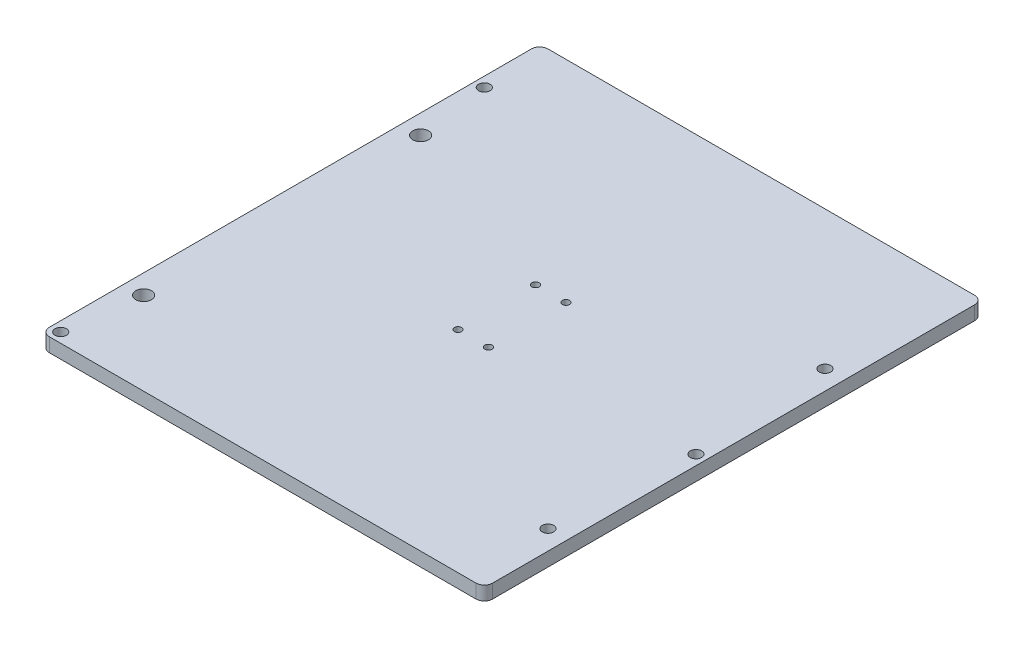
ISO-10303-21;
HEADER;
FILE_DESCRIPTION(('STEP AP214'),'2;1');
FILE_NAME('part.step','',(''),(''),'','','');
FILE_SCHEMA(('AUTOMOTIVE_DESIGN { 1 0 10303 214 1 1 1 1 }'));
ENDSEC;
DATA;
#1=APPLICATION_CONTEXT('core data for automotive mechanical design processes');
#2=APPLICATION_PROTOCOL_DEFINITION('international standard','automotive_design',2000,#1);
#3=PRODUCT_CONTEXT('',#1,'mechanical');
#4=PRODUCT('Part','Part','',(#3));
#5=PRODUCT_RELATED_PRODUCT_CATEGORY('part','',(#4));
#6=PRODUCT_DEFINITION_FORMATION('','',#4);
#7=PRODUCT_DEFINITION_CONTEXT('part definition',#1,'design');
#8=PRODUCT_DEFINITION('design','',#6,#7);
#9=PRODUCT_DEFINITION_SHAPE('','',#8);
#10=(LENGTH_UNIT() NAMED_UNIT(*) SI_UNIT(.MILLI.,.METRE.));
#11=(NAMED_UNIT(*) PLANE_ANGLE_UNIT() SI_UNIT($,.RADIAN.));
#12=(NAMED_UNIT(*) SI_UNIT($,.STERADIAN.) SOLID_ANGLE_UNIT());
#13=UNCERTAINTY_MEASURE_WITH_UNIT(LENGTH_MEASURE(1.E-05),#10,'distance_accuracy_value','');
#14=(GEOMETRIC_REPRESENTATION_CONTEXT(3) GLOBAL_UNCERTAINTY_ASSIGNED_CONTEXT((#13)) GLOBAL_UNIT_ASSIGNED_CONTEXT((#10,
#11,#12)) REPRESENTATION_CONTEXT('',''));
#15=CARTESIAN_POINT('',(0.,0.,0.));
#16=DIRECTION('',(0.,0.,1.));
#17=DIRECTION('',(1.,0.,0.));
#18=AXIS2_PLACEMENT_3D('',#15,#16,#17);
#19=CARTESIAN_POINT('',(0.,6.35,25.4));
#20=DIRECTION('',(0.,0.,-1.));
#21=DIRECTION('',(-1.,0.,0.));
#22=AXIS2_PLACEMENT_3D('',#19,#20,#21);
#23=PLANE('',#22);
#24=DIRECTION('',(1.,0.,0.));
#25=VECTOR('',#24,1.);
#26=CARTESIAN_POINT('',(0.,0.,25.4));
#27=LINE('',#26,#25);
#28=CARTESIAN_POINT('',(3.81,0.,25.4));
#29=VERTEX_POINT('',#28);
#30=CARTESIAN_POINT('',(199.39,0.,25.4));
#31=VERTEX_POINT('',#30);
#32=EDGE_CURVE('E130',#29,#31,#27,.T.);
#33=ORIENTED_EDGE('',*,*,#32,.T.);
#34=DIRECTION('',(0.,-1.,0.));
#35=VECTOR('',#34,1.);
#36=CARTESIAN_POINT('',(199.39,6.35,25.4));
#37=LINE('',#36,#35);
#38=CARTESIAN_POINT('',(199.39,6.35,25.4));
#39=VERTEX_POINT('',#38);
#40=EDGE_CURVE('E11',#31,#39,#37,.F.);
#41=ORIENTED_EDGE('',*,*,#40,.T.);
#42=DIRECTION('',(1.,0.,0.));
#43=VECTOR('',#42,1.);
#44=CARTESIAN_POINT('',(0.,6.35,25.4));
#45=LINE('',#44,#43);
#46=CARTESIAN_POINT('',(3.81,6.35,25.4));
#47=VERTEX_POINT('',#46);
#48=EDGE_CURVE('E156',#47,#39,#45,.T.);
#49=ORIENTED_EDGE('',*,*,#48,.F.);
#50=DIRECTION('',(0.,-1.,0.));
#51=VECTOR('',#50,1.);
#52=CARTESIAN_POINT('',(3.81,6.35,25.4));
#53=LINE('',#52,#51);
#54=EDGE_CURVE('E41',#47,#29,#53,.T.);
#55=ORIENTED_EDGE('',*,*,#54,.T.);
#56=EDGE_LOOP('',(#33,#41,#49,#55));
#57=FACE_BOUND('',#56,.T.);
#58=ADVANCED_FACE('F33',(#57),#23,.F.);
#59=CARTESIAN_POINT('',(203.2,6.35,0.));
#60=DIRECTION('',(-1.,0.,0.));
#61=DIRECTION('',(0.,0.,1.));
#62=AXIS2_PLACEMENT_3D('',#59,#60,#61);
#63=PLANE('',#62);
#64=DIRECTION('',(0.,0.,-1.));
#65=VECTOR('',#64,1.);
#66=CARTESIAN_POINT('',(203.2,0.,0.));
#67=LINE('',#66,#65);
#68=CARTESIAN_POINT('',(203.2,0.,21.59));
#69=VERTEX_POINT('',#68);
#70=CARTESIAN_POINT('',(203.2,0.,-199.39));
#71=VERTEX_POINT('',#70);
#72=EDGE_CURVE('E125',#69,#71,#67,.T.);
#73=ORIENTED_EDGE('',*,*,#72,.T.);
#74=DIRECTION('',(0.,-1.,0.));
#75=VECTOR('',#74,1.);
#76=CARTESIAN_POINT('',(203.2,6.35,-199.39));
#77=LINE('',#76,#75);
#78=CARTESIAN_POINT('',(203.2,6.35,-199.39));
#79=VERTEX_POINT('',#78);
#80=EDGE_CURVE('E103',#71,#79,#77,.F.);
#81=ORIENTED_EDGE('',*,*,#80,.T.);
#82=DIRECTION('',(0.,0.,-1.));
#83=VECTOR('',#82,1.);
#84=CARTESIAN_POINT('',(203.2,6.35,0.));
#85=LINE('',#84,#83);
#86=CARTESIAN_POINT('',(203.2,6.35,21.59));
#87=VERTEX_POINT('',#86);
#88=EDGE_CURVE('E164',#87,#79,#85,.T.);
#89=ORIENTED_EDGE('',*,*,#88,.F.);
#90=DIRECTION('',(0.,-1.,0.));
#91=VECTOR('',#90,1.);
#92=CARTESIAN_POINT('',(203.2,6.35,21.59));
#93=LINE('',#92,#91);
#94=EDGE_CURVE('E108',#87,#69,#93,.T.);
#95=ORIENTED_EDGE('',*,*,#94,.T.);
#96=EDGE_LOOP('',(#73,#81,#89,#95));
#97=FACE_BOUND('',#96,.T.);
#98=ADVANCED_FACE('F263',(#97),#63,.F.);
#99=CARTESIAN_POINT('',(0.,6.35,-203.2));
#100=DIRECTION('',(0.,0.,1.));
#101=DIRECTION('',(1.,0.,0.));
#102=AXIS2_PLACEMENT_3D('',#99,#100,#101);
#103=PLANE('',#102);
#104=DIRECTION('',(-1.,0.,0.));
#105=VECTOR('',#104,1.);
#106=CARTESIAN_POINT('',(0.,6.35,-203.2));
#107=LINE('',#106,#105);
#108=CARTESIAN_POINT('',(199.39,6.35,-203.2));
#109=VERTEX_POINT('',#108);
#110=CARTESIAN_POINT('',(3.81,6.35,-203.2));
#111=VERTEX_POINT('',#110);
#112=EDGE_CURVE('E118',#109,#111,#107,.T.);
#113=ORIENTED_EDGE('',*,*,#112,.F.);
#114=DIRECTION('',(0.,-1.,0.));
#115=VECTOR('',#114,1.);
#116=CARTESIAN_POINT('',(199.39,6.35,-203.2));
#117=LINE('',#116,#115);
#118=CARTESIAN_POINT('',(199.39,0.,-203.2));
#119=VERTEX_POINT('',#118);
#120=EDGE_CURVE('E102',#109,#119,#117,.T.);
#121=ORIENTED_EDGE('',*,*,#120,.T.);
#122=DIRECTION('',(-1.,0.,0.));
#123=VECTOR('',#122,1.);
#124=CARTESIAN_POINT('',(0.,0.,-203.2));
#125=LINE('',#124,#123);
#126=CARTESIAN_POINT('',(3.81,0.,-203.2));
#127=VERTEX_POINT('',#126);
#128=EDGE_CURVE('E115',#119,#127,#125,.T.);
#129=ORIENTED_EDGE('',*,*,#128,.T.);
#130=DIRECTION('',(0.,-1.,0.));
#131=VECTOR('',#130,1.);
#132=CARTESIAN_POINT('',(3.81,6.35,-203.2));
#133=LINE('',#132,#131);
#134=EDGE_CURVE('E120',#127,#111,#133,.F.);
#135=ORIENTED_EDGE('',*,*,#134,.T.);
#136=EDGE_LOOP('',(#113,#121,#129,#135));
#137=FACE_BOUND('',#136,.T.);
#138=ADVANCED_FACE('F114',(#137),#103,.F.);
#139=CARTESIAN_POINT('',(0.,6.35,0.));
#140=DIRECTION('',(1.,0.,0.));
#141=DIRECTION('',(0.,0.,-1.));
#142=AXIS2_PLACEMENT_3D('',#139,#140,#141);
#143=PLANE('',#142);
#144=DIRECTION('',(0.,0.,1.));
#145=VECTOR('',#144,1.);
#146=CARTESIAN_POINT('',(0.,6.35,0.));
#147=LINE('',#146,#145);
#148=CARTESIAN_POINT('',(0.,6.35,-199.39));
#149=VERTEX_POINT('',#148);
#150=CARTESIAN_POINT('',(0.,6.35,21.59));
#151=VERTEX_POINT('',#150);
#152=EDGE_CURVE('E128',#149,#151,#147,.T.);
#153=ORIENTED_EDGE('',*,*,#152,.F.);
#154=DIRECTION('',(0.,-1.,0.));
#155=VECTOR('',#154,1.);
#156=CARTESIAN_POINT('',(0.,6.35,-199.39));
#157=LINE('',#156,#155);
#158=CARTESIAN_POINT('',(0.,0.,-199.39));
#159=VERTEX_POINT('',#158);
#160=EDGE_CURVE('E151',#149,#159,#157,.T.);
#161=ORIENTED_EDGE('',*,*,#160,.T.);
#162=DIRECTION('',(0.,0.,1.));
#163=VECTOR('',#162,1.);
#164=CARTESIAN_POINT('',(0.,0.,0.));
#165=LINE('',#164,#163);
#166=CARTESIAN_POINT('',(0.,0.,21.59));
#167=VERTEX_POINT('',#166);
#168=EDGE_CURVE('E124',#159,#167,#165,.T.);
#169=ORIENTED_EDGE('',*,*,#168,.T.);
#170=DIRECTION('',(0.,-1.,0.));
#171=VECTOR('',#170,1.);
#172=CARTESIAN_POINT('',(0.,6.35,21.59));
#173=LINE('',#172,#171);
#174=EDGE_CURVE('E149',#167,#151,#173,.F.);
#175=ORIENTED_EDGE('',*,*,#174,.T.);
#176=EDGE_LOOP('',(#153,#161,#169,#175));
#177=FACE_BOUND('',#176,.T.);
#178=ADVANCED_FACE('F238',(#177),#143,.F.);
#179=CARTESIAN_POINT('',(0.,6.35,0.));
#180=DIRECTION('',(0.,1.,0.));
#181=DIRECTION('',(0.,0.,1.));
#182=AXIS2_PLACEMENT_3D('',#179,#180,#181);
#183=PLANE('',#182);
#184=CARTESIAN_POINT('',(94.6,6.35,-71.12));
#185=DIRECTION('',(0.,1.,0.));
#186=DIRECTION('',(0.,0.,-1.));
#187=AXIS2_PLACEMENT_3D('',#184,#185,#186);
#188=CIRCLE('',#187,1.65);
#189=CARTESIAN_POINT('',(94.6,6.35,-72.77));
#190=VERTEX_POINT('',#189);
#191=EDGE_CURVE('E228',#190,#190,#188,.T.);
#192=ORIENTED_EDGE('',*,*,#191,.F.);
#193=EDGE_LOOP('',(#192));
#194=FACE_BOUND('',#193,.T.);
#195=CARTESIAN_POINT('',(108.6,6.35,-71.12));
#196=DIRECTION('',(0.,1.,0.));
#197=DIRECTION('',(0.,0.,-1.));
#198=AXIS2_PLACEMENT_3D('',#195,#196,#197);
#199=CIRCLE('',#198,1.65);
#200=CARTESIAN_POINT('',(108.6,6.35,-72.77));
#201=VERTEX_POINT('',#200);
#202=EDGE_CURVE('E222',#201,#201,#199,.T.);
#203=ORIENTED_EDGE('',*,*,#202,.F.);
#204=EDGE_LOOP('',(#203));
#205=FACE_BOUND('',#204,.T.);
#206=CARTESIAN_POINT('',(108.6,6.35,-106.68));
#207=DIRECTION('',(0.,1.,0.));
#208=DIRECTION('',(0.,0.,1.));
#209=AXIS2_PLACEMENT_3D('',#206,#207,#208);
#210=CIRCLE('',#209,1.65);
#211=CARTESIAN_POINT('',(108.6,6.35,-105.03));
#212=VERTEX_POINT('',#211);
#213=EDGE_CURVE('E216',#212,#212,#210,.T.);
#214=ORIENTED_EDGE('',*,*,#213,.F.);
#215=EDGE_LOOP('',(#214));
#216=FACE_BOUND('',#215,.T.);
#217=CARTESIAN_POINT('',(94.6,6.35,-106.68));
#218=DIRECTION('',(0.,1.,0.));
#219=DIRECTION('',(0.,0.,1.));
#220=AXIS2_PLACEMENT_3D('',#217,#218,#219);
#221=CIRCLE('',#220,1.65);
#222=CARTESIAN_POINT('',(94.6,6.35,-105.03));
#223=VERTEX_POINT('',#222);
#224=EDGE_CURVE('E210',#223,#223,#221,.T.);
#225=ORIENTED_EDGE('',*,*,#224,.F.);
#226=EDGE_LOOP('',(#225));
#227=FACE_BOUND('',#226,.T.);
#228=CARTESIAN_POINT('',(198.6499964,6.35,-76.2));
#229=DIRECTION('',(0.,1.,0.));
#230=DIRECTION('',(0.,0.,1.));
#231=AXIS2_PLACEMENT_3D('',#228,#229,#230);
#232=CIRCLE('',#231,2.625);
#233=CARTESIAN_POINT('',(198.6499964,6.35,-73.575));
#234=VERTEX_POINT('',#233);
#235=EDGE_CURVE('E202',#234,#234,#232,.F.);
#236=ORIENTED_EDGE('',*,*,#235,.T.);
#237=EDGE_LOOP('',(#236));
#238=FACE_BOUND('',#237,.T.);
#239=CARTESIAN_POINT('',(4.50088,6.35,-173.29912));
#240=DIRECTION('',(0.,1.,0.));
#241=DIRECTION('',(0.,0.,1.));
#242=AXIS2_PLACEMENT_3D('',#239,#240,#241);
#243=CIRCLE('',#242,2.625);
#244=CARTESIAN_POINT('',(4.50088,6.35,-170.67412));
#245=VERTEX_POINT('',#244);
#246=EDGE_CURVE('E196',#245,#245,#243,.F.);
#247=ORIENTED_EDGE('',*,*,#246,.T.);
#248=EDGE_LOOP('',(#247));
#249=FACE_BOUND('',#248,.T.);
#250=CARTESIAN_POINT('',(4.50088,6.35,20.90166));
#251=DIRECTION('',(0.,1.,0.));
#252=DIRECTION('',(0.,0.,1.));
#253=AXIS2_PLACEMENT_3D('',#250,#251,#252);
#254=CIRCLE('',#253,2.625);
#255=CARTESIAN_POINT('',(4.50088,6.35,23.52666));
#256=VERTEX_POINT('',#255);
#257=EDGE_CURVE('E190',#256,#256,#254,.F.);
#258=ORIENTED_EDGE('',*,*,#257,.T.);
#259=EDGE_LOOP('',(#258));
#260=FACE_BOUND('',#259,.T.);
#261=CARTESIAN_POINT('',(194.29857,6.35,-139.7));
#262=DIRECTION('',(0.,1.,0.));
#263=DIRECTION('',(0.,0.,-1.));
#264=AXIS2_PLACEMENT_3D('',#261,#262,#263);
#265=CIRCLE('',#264,2.625);
#266=CARTESIAN_POINT('',(194.29857,6.35,-142.325));
#267=VERTEX_POINT('',#266);
#268=EDGE_CURVE('E186',#267,#267,#265,.T.);
#269=ORIENTED_EDGE('',*,*,#268,.F.);
#270=EDGE_LOOP('',(#269));
#271=FACE_BOUND('',#270,.T.);
#272=CARTESIAN_POINT('',(194.29857,6.35,-12.7));
#273=DIRECTION('',(0.,1.,0.));
#274=DIRECTION('',(0.,0.,-1.));
#275=AXIS2_PLACEMENT_3D('',#272,#273,#274);
#276=CIRCLE('',#275,2.625);
#277=CARTESIAN_POINT('',(194.29857,6.35,-15.325));
#278=VERTEX_POINT('',#277);
#279=EDGE_CURVE('E180',#278,#278,#276,.T.);
#280=ORIENTED_EDGE('',*,*,#279,.F.);
#281=EDGE_LOOP('',(#280));
#282=FACE_BOUND('',#281,.T.);
#283=CARTESIAN_POINT('',(8.90142999999999,6.35,-139.7));
#284=DIRECTION('',(0.,1.,0.));
#285=DIRECTION('',(0.,0.,1.));
#286=AXIS2_PLACEMENT_3D('',#283,#284,#285);
#287=CIRCLE('',#286,3.59999999999999);
#288=CARTESIAN_POINT('',(8.90142999999999,6.35,-136.1));
#289=VERTEX_POINT('',#288);
#290=EDGE_CURVE('E174',#289,#289,#287,.T.);
#291=ORIENTED_EDGE('',*,*,#290,.F.);
#292=EDGE_LOOP('',(#291));
#293=FACE_BOUND('',#292,.T.);
#294=CARTESIAN_POINT('',(8.90143000000001,6.35,-12.7));
#295=DIRECTION('',(0.,1.,0.));
#296=DIRECTION('',(0.,0.,1.));
#297=AXIS2_PLACEMENT_3D('',#294,#295,#296);
#298=CIRCLE('',#297,3.6);
#299=CARTESIAN_POINT('',(8.90143000000001,6.35,-9.1));
#300=VERTEX_POINT('',#299);
#301=EDGE_CURVE('E160',#300,#300,#298,.T.);
#302=ORIENTED_EDGE('',*,*,#301,.F.);
#303=EDGE_LOOP('',(#302));
#304=FACE_BOUND('',#303,.T.);
#305=ORIENTED_EDGE('',*,*,#88,.T.);
#306=CARTESIAN_POINT('',(199.39,6.35,-199.39));
#307=DIRECTION('',(0.,1.,0.));
#308=DIRECTION('',(0.,0.,1.));
#309=AXIS2_PLACEMENT_3D('',#306,#307,#308);
#310=CIRCLE('',#309,3.81);
#311=EDGE_CURVE('E147',#79,#109,#310,.T.);
#312=ORIENTED_EDGE('',*,*,#311,.T.);
#313=ORIENTED_EDGE('',*,*,#112,.T.);
#314=CARTESIAN_POINT('',(3.81,6.35,-199.39));
#315=DIRECTION('',(0.,1.,0.));
#316=DIRECTION('',(0.,0.,1.));
#317=AXIS2_PLACEMENT_3D('',#314,#315,#316);
#318=CIRCLE('',#317,3.81);
#319=EDGE_CURVE('E145',#111,#149,#318,.T.);
#320=ORIENTED_EDGE('',*,*,#319,.T.);
#321=ORIENTED_EDGE('',*,*,#152,.T.);
#322=CARTESIAN_POINT('',(3.81,6.35,21.59));
#323=DIRECTION('',(0.,1.,0.));
#324=DIRECTION('',(0.,0.,1.));
#325=AXIS2_PLACEMENT_3D('',#322,#323,#324);
#326=CIRCLE('',#325,3.81);
#327=EDGE_CURVE('E53',#151,#47,#326,.T.);
#328=ORIENTED_EDGE('',*,*,#327,.T.);
#329=ORIENTED_EDGE('',*,*,#48,.T.);
#330=CARTESIAN_POINT('',(199.39,6.35,21.59));
#331=DIRECTION('',(0.,1.,0.));
#332=DIRECTION('',(0.,0.,1.));
#333=AXIS2_PLACEMENT_3D('',#330,#331,#332);
#334=CIRCLE('',#333,3.81);
#335=EDGE_CURVE('E143',#39,#87,#334,.T.);
#336=ORIENTED_EDGE('',*,*,#335,.T.);
#337=EDGE_LOOP('',(#305,#312,#313,#320,#321,#328,#329,#336));
#338=FACE_BOUND('',#337,.T.);
#339=ADVANCED_FACE('F235',(#194,#205,#216,#227,#238,#249,#260,#271,#282,#293,#304,#338),#183,.T.);
#340=CARTESIAN_POINT('',(0.,0.,0.));
#341=DIRECTION('',(0.,1.,0.));
#342=DIRECTION('',(0.,0.,1.));
#343=AXIS2_PLACEMENT_3D('',#340,#341,#342);
#344=PLANE('',#343);
#345=CARTESIAN_POINT('',(94.6,0.,-71.12));
#346=DIRECTION('',(0.,1.,0.));
#347=DIRECTION('',(0.,0.,1.));
#348=AXIS2_PLACEMENT_3D('',#345,#346,#347);
#349=CIRCLE('',#348,1.65);
#350=CARTESIAN_POINT('',(94.6,0.,-69.47));
#351=VERTEX_POINT('',#350);
#352=EDGE_CURVE('E225',#351,#351,#349,.F.);
#353=ORIENTED_EDGE('',*,*,#352,.F.);
#354=EDGE_LOOP('',(#353));
#355=FACE_BOUND('',#354,.T.);
#356=CARTESIAN_POINT('',(108.6,0.,-71.12));
#357=DIRECTION('',(0.,1.,0.));
#358=DIRECTION('',(0.,0.,1.));
#359=AXIS2_PLACEMENT_3D('',#356,#357,#358);
#360=CIRCLE('',#359,1.65);
#361=CARTESIAN_POINT('',(108.6,0.,-69.47));
#362=VERTEX_POINT('',#361);
#363=EDGE_CURVE('E219',#362,#362,#360,.F.);
#364=ORIENTED_EDGE('',*,*,#363,.F.);
#365=EDGE_LOOP('',(#364));
#366=FACE_BOUND('',#365,.T.);
#367=CARTESIAN_POINT('',(108.6,0.,-106.68));
#368=DIRECTION('',(0.,1.,0.));
#369=DIRECTION('',(0.,0.,1.));
#370=AXIS2_PLACEMENT_3D('',#367,#368,#369);
#371=CIRCLE('',#370,1.65);
#372=CARTESIAN_POINT('',(108.6,0.,-105.03));
#373=VERTEX_POINT('',#372);
#374=EDGE_CURVE('E213',#373,#373,#371,.F.);
#375=ORIENTED_EDGE('',*,*,#374,.F.);
#376=EDGE_LOOP('',(#375));
#377=FACE_BOUND('',#376,.T.);
#378=CARTESIAN_POINT('',(94.6,0.,-106.68));
#379=DIRECTION('',(0.,1.,0.));
#380=DIRECTION('',(0.,0.,1.));
#381=AXIS2_PLACEMENT_3D('',#378,#379,#380);
#382=CIRCLE('',#381,1.65);
#383=CARTESIAN_POINT('',(94.6,0.,-105.03));
#384=VERTEX_POINT('',#383);
#385=EDGE_CURVE('E205',#384,#384,#382,.F.);
#386=ORIENTED_EDGE('',*,*,#385,.F.);
#387=EDGE_LOOP('',(#386));
#388=FACE_BOUND('',#387,.T.);
#389=CARTESIAN_POINT('',(198.6499964,0.,-76.2));
#390=DIRECTION('',(0.,-1.,0.));
#391=DIRECTION('',(0.,0.,-1.));
#392=AXIS2_PLACEMENT_3D('',#389,#390,#391);
#393=CIRCLE('',#392,2.625);
#394=CARTESIAN_POINT('',(198.6499964,0.,-78.825));
#395=VERTEX_POINT('',#394);
#396=EDGE_CURVE('E199',#395,#395,#393,.T.);
#397=ORIENTED_EDGE('',*,*,#396,.F.);
#398=EDGE_LOOP('',(#397));
#399=FACE_BOUND('',#398,.T.);
#400=CARTESIAN_POINT('',(4.50088,0.,-173.29912));
#401=DIRECTION('',(0.,-1.,0.));
#402=DIRECTION('',(0.,0.,-1.));
#403=AXIS2_PLACEMENT_3D('',#400,#401,#402);
#404=CIRCLE('',#403,2.625);
#405=CARTESIAN_POINT('',(4.50088,0.,-175.92412));
#406=VERTEX_POINT('',#405);
#407=EDGE_CURVE('E193',#406,#406,#404,.T.);
#408=ORIENTED_EDGE('',*,*,#407,.F.);
#409=EDGE_LOOP('',(#408));
#410=FACE_BOUND('',#409,.T.);
#411=CARTESIAN_POINT('',(4.50088,0.,20.90166));
#412=DIRECTION('',(0.,-1.,0.));
#413=DIRECTION('',(0.,0.,-1.));
#414=AXIS2_PLACEMENT_3D('',#411,#412,#413);
#415=CIRCLE('',#414,2.625);
#416=CARTESIAN_POINT('',(4.50088,0.,18.27666));
#417=VERTEX_POINT('',#416);
#418=EDGE_CURVE('E189',#417,#417,#415,.T.);
#419=ORIENTED_EDGE('',*,*,#418,.F.);
#420=EDGE_LOOP('',(#419));
#421=FACE_BOUND('',#420,.T.);
#422=CARTESIAN_POINT('',(194.29857,0.,-139.7));
#423=DIRECTION('',(0.,1.,0.));
#424=DIRECTION('',(0.,0.,1.));
#425=AXIS2_PLACEMENT_3D('',#422,#423,#424);
#426=CIRCLE('',#425,2.625);
#427=CARTESIAN_POINT('',(194.29857,0.,-137.075));
#428=VERTEX_POINT('',#427);
#429=EDGE_CURVE('E183',#428,#428,#426,.F.);
#430=ORIENTED_EDGE('',*,*,#429,.F.);
#431=EDGE_LOOP('',(#430));
#432=FACE_BOUND('',#431,.T.);
#433=CARTESIAN_POINT('',(194.29857,0.,-12.7));
#434=DIRECTION('',(0.,1.,0.));
#435=DIRECTION('',(0.,0.,1.));
#436=AXIS2_PLACEMENT_3D('',#433,#434,#435);
#437=CIRCLE('',#436,2.625);
#438=CARTESIAN_POINT('',(194.29857,0.,-10.075));
#439=VERTEX_POINT('',#438);
#440=EDGE_CURVE('E177',#439,#439,#437,.F.);
#441=ORIENTED_EDGE('',*,*,#440,.F.);
#442=EDGE_LOOP('',(#441));
#443=FACE_BOUND('',#442,.T.);
#444=CARTESIAN_POINT('',(8.90142999999999,0.,-139.7));
#445=DIRECTION('',(0.,1.,0.));
#446=DIRECTION('',(0.,0.,1.));
#447=AXIS2_PLACEMENT_3D('',#444,#445,#446);
#448=CIRCLE('',#447,3.59999999999999);
#449=CARTESIAN_POINT('',(8.90142999999999,0.,-136.1));
#450=VERTEX_POINT('',#449);
#451=EDGE_CURVE('E171',#450,#450,#448,.F.);
#452=ORIENTED_EDGE('',*,*,#451,.F.);
#453=EDGE_LOOP('',(#452));
#454=FACE_BOUND('',#453,.T.);
#455=CARTESIAN_POINT('',(8.90143000000001,0.,-12.7));
#456=DIRECTION('',(0.,1.,0.));
#457=DIRECTION('',(0.,0.,1.));
#458=AXIS2_PLACEMENT_3D('',#455,#456,#457);
#459=CIRCLE('',#458,3.6);
#460=CARTESIAN_POINT('',(8.90143000000001,0.,-9.1));
#461=VERTEX_POINT('',#460);
#462=EDGE_CURVE('E158',#461,#461,#459,.F.);
#463=ORIENTED_EDGE('',*,*,#462,.F.);
#464=EDGE_LOOP('',(#463));
#465=FACE_BOUND('',#464,.T.);
#466=ORIENTED_EDGE('',*,*,#128,.F.);
#467=CARTESIAN_POINT('',(199.39,0.,-199.39));
#468=DIRECTION('',(0.,1.,0.));
#469=DIRECTION('',(0.,0.,1.));
#470=AXIS2_PLACEMENT_3D('',#467,#468,#469);
#471=CIRCLE('',#470,3.81);
#472=EDGE_CURVE('E98',#119,#71,#471,.F.);
#473=ORIENTED_EDGE('',*,*,#472,.T.);
#474=ORIENTED_EDGE('',*,*,#72,.F.);
#475=CARTESIAN_POINT('',(199.39,0.,21.59));
#476=DIRECTION('',(0.,1.,0.));
#477=DIRECTION('',(0.,0.,1.));
#478=AXIS2_PLACEMENT_3D('',#475,#476,#477);
#479=CIRCLE('',#478,3.81);
#480=EDGE_CURVE('E136',#69,#31,#479,.F.);
#481=ORIENTED_EDGE('',*,*,#480,.T.);
#482=ORIENTED_EDGE('',*,*,#32,.F.);
#483=CARTESIAN_POINT('',(3.81,0.,21.59));
#484=DIRECTION('',(0.,1.,0.));
#485=DIRECTION('',(0.,0.,1.));
#486=AXIS2_PLACEMENT_3D('',#483,#484,#485);
#487=CIRCLE('',#486,3.81);
#488=EDGE_CURVE('E119',#29,#167,#487,.F.);
#489=ORIENTED_EDGE('',*,*,#488,.T.);
#490=ORIENTED_EDGE('',*,*,#168,.F.);
#491=CARTESIAN_POINT('',(3.81,0.,-199.39));
#492=DIRECTION('',(0.,1.,0.));
#493=DIRECTION('',(0.,0.,1.));
#494=AXIS2_PLACEMENT_3D('',#491,#492,#493);
#495=CIRCLE('',#494,3.81);
#496=EDGE_CURVE('E109',#159,#127,#495,.F.);
#497=ORIENTED_EDGE('',*,*,#496,.T.);
#498=EDGE_LOOP('',(#466,#473,#474,#481,#482,#489,#490,#497));
#499=FACE_BOUND('',#498,.T.);
#500=ADVANCED_FACE('F122',(#355,#366,#377,#388,#399,#410,#421,#432,#443,#454,#465,#499),#344,.F.);
#501=CARTESIAN_POINT('',(8.90143000000001,-0.00100000000000013,-12.7));
#502=DIRECTION('',(0.,1.,0.));
#503=DIRECTION('',(0.,0.,1.));
#504=AXIS2_PLACEMENT_3D('',#501,#502,#503);
#505=CYLINDRICAL_SURFACE('',#504,3.6);
#506=ORIENTED_EDGE('',*,*,#301,.T.);
#507=EDGE_LOOP('',(#506));
#508=FACE_BOUND('',#507,.T.);
#509=ORIENTED_EDGE('',*,*,#462,.T.);
#510=EDGE_LOOP('',(#509));
#511=FACE_BOUND('',#510,.T.);
#512=ADVANCED_FACE('F315',(#508,#511),#505,.F.);
#513=CARTESIAN_POINT('',(8.90142999999999,-0.00100000000000013,-139.7));
#514=DIRECTION('',(0.,1.,0.));
#515=DIRECTION('',(0.,0.,1.));
#516=AXIS2_PLACEMENT_3D('',#513,#514,#515);
#517=CYLINDRICAL_SURFACE('',#516,3.59999999999999);
#518=ORIENTED_EDGE('',*,*,#290,.T.);
#519=EDGE_LOOP('',(#518));
#520=FACE_BOUND('',#519,.T.);
#521=ORIENTED_EDGE('',*,*,#451,.T.);
#522=EDGE_LOOP('',(#521));
#523=FACE_BOUND('',#522,.T.);
#524=ADVANCED_FACE('F311',(#520,#523),#517,.F.);
#525=CARTESIAN_POINT('',(194.29857,-0.00100000000000013,-12.7));
#526=DIRECTION('',(0.,1.,0.));
#527=DIRECTION('',(0.,0.,1.));
#528=AXIS2_PLACEMENT_3D('',#525,#526,#527);
#529=CYLINDRICAL_SURFACE('',#528,2.625);
#530=ORIENTED_EDGE('',*,*,#279,.T.);
#531=EDGE_LOOP('',(#530));
#532=FACE_BOUND('',#531,.T.);
#533=ORIENTED_EDGE('',*,*,#440,.T.);
#534=EDGE_LOOP('',(#533));
#535=FACE_BOUND('',#534,.T.);
#536=ADVANCED_FACE('F307',(#532,#535),#529,.F.);
#537=CARTESIAN_POINT('',(194.29857,-0.00100000000000013,-139.7));
#538=DIRECTION('',(0.,1.,0.));
#539=DIRECTION('',(0.,0.,1.));
#540=AXIS2_PLACEMENT_3D('',#537,#538,#539);
#541=CYLINDRICAL_SURFACE('',#540,2.625);
#542=ORIENTED_EDGE('',*,*,#268,.T.);
#543=EDGE_LOOP('',(#542));
#544=FACE_BOUND('',#543,.T.);
#545=ORIENTED_EDGE('',*,*,#429,.T.);
#546=EDGE_LOOP('',(#545));
#547=FACE_BOUND('',#546,.T.);
#548=ADVANCED_FACE('F303',(#544,#547),#541,.F.);
#549=CARTESIAN_POINT('',(4.50088,6.351,20.90166));
#550=DIRECTION('',(0.,-1.,0.));
#551=DIRECTION('',(0.,0.,-1.));
#552=AXIS2_PLACEMENT_3D('',#549,#550,#551);
#553=CYLINDRICAL_SURFACE('',#552,2.625);
#554=ORIENTED_EDGE('',*,*,#257,.F.);
#555=EDGE_LOOP('',(#554));
#556=FACE_BOUND('',#555,.T.);
#557=ORIENTED_EDGE('',*,*,#418,.T.);
#558=EDGE_LOOP('',(#557));
#559=FACE_BOUND('',#558,.T.);
#560=ADVANCED_FACE('F294',(#556,#559),#553,.F.);
#561=CARTESIAN_POINT('',(4.50088,6.351,-173.29912));
#562=DIRECTION('',(0.,-1.,0.));
#563=DIRECTION('',(0.,0.,-1.));
#564=AXIS2_PLACEMENT_3D('',#561,#562,#563);
#565=CYLINDRICAL_SURFACE('',#564,2.625);
#566=ORIENTED_EDGE('',*,*,#246,.F.);
#567=EDGE_LOOP('',(#566));
#568=FACE_BOUND('',#567,.T.);
#569=ORIENTED_EDGE('',*,*,#407,.T.);
#570=EDGE_LOOP('',(#569));
#571=FACE_BOUND('',#570,.T.);
#572=ADVANCED_FACE('F288',(#568,#571),#565,.F.);
#573=CARTESIAN_POINT('',(198.6499964,6.351,-76.2));
#574=DIRECTION('',(0.,-1.,0.));
#575=DIRECTION('',(0.,0.,-1.));
#576=AXIS2_PLACEMENT_3D('',#573,#574,#575);
#577=CYLINDRICAL_SURFACE('',#576,2.625);
#578=ORIENTED_EDGE('',*,*,#235,.F.);
#579=EDGE_LOOP('',(#578));
#580=FACE_BOUND('',#579,.T.);
#581=ORIENTED_EDGE('',*,*,#396,.T.);
#582=EDGE_LOOP('',(#581));
#583=FACE_BOUND('',#582,.T.);
#584=ADVANCED_FACE('F284',(#580,#583),#577,.F.);
#585=CARTESIAN_POINT('',(199.39,6.35,-199.39));
#586=DIRECTION('',(0.,-1.,0.));
#587=DIRECTION('',(0.,0.,-1.));
#588=AXIS2_PLACEMENT_3D('',#585,#586,#587);
#589=CYLINDRICAL_SURFACE('',#588,3.81);
#590=ORIENTED_EDGE('',*,*,#311,.F.);
#591=ORIENTED_EDGE('',*,*,#80,.F.);
#592=ORIENTED_EDGE('',*,*,#472,.F.);
#593=ORIENTED_EDGE('',*,*,#120,.F.);
#594=EDGE_LOOP('',(#590,#591,#592,#593));
#595=FACE_BOUND('',#594,.T.);
#596=ADVANCED_FACE('F101',(#595),#589,.T.);
#597=CARTESIAN_POINT('',(3.81,6.35,-199.39));
#598=DIRECTION('',(0.,-1.,0.));
#599=DIRECTION('',(0.,0.,-1.));
#600=AXIS2_PLACEMENT_3D('',#597,#598,#599);
#601=CYLINDRICAL_SURFACE('',#600,3.81);
#602=ORIENTED_EDGE('',*,*,#319,.F.);
#603=ORIENTED_EDGE('',*,*,#134,.F.);
#604=ORIENTED_EDGE('',*,*,#496,.F.);
#605=ORIENTED_EDGE('',*,*,#160,.F.);
#606=EDGE_LOOP('',(#602,#603,#604,#605));
#607=FACE_BOUND('',#606,.T.);
#608=ADVANCED_FACE('F267',(#607),#601,.T.);
#609=CARTESIAN_POINT('',(199.39,6.35,21.59));
#610=DIRECTION('',(0.,-1.,0.));
#611=DIRECTION('',(0.,0.,-1.));
#612=AXIS2_PLACEMENT_3D('',#609,#610,#611);
#613=CYLINDRICAL_SURFACE('',#612,3.81);
#614=ORIENTED_EDGE('',*,*,#335,.F.);
#615=ORIENTED_EDGE('',*,*,#40,.F.);
#616=ORIENTED_EDGE('',*,*,#480,.F.);
#617=ORIENTED_EDGE('',*,*,#94,.F.);
#618=EDGE_LOOP('',(#614,#615,#616,#617));
#619=FACE_BOUND('',#618,.T.);
#620=ADVANCED_FACE('F265',(#619),#613,.T.);
#621=CARTESIAN_POINT('',(3.81,6.35,21.59));
#622=DIRECTION('',(0.,-1.,0.));
#623=DIRECTION('',(0.,0.,-1.));
#624=AXIS2_PLACEMENT_3D('',#621,#622,#623);
#625=CYLINDRICAL_SURFACE('',#624,3.81);
#626=ORIENTED_EDGE('',*,*,#327,.F.);
#627=ORIENTED_EDGE('',*,*,#174,.F.);
#628=ORIENTED_EDGE('',*,*,#488,.F.);
#629=ORIENTED_EDGE('',*,*,#54,.F.);
#630=EDGE_LOOP('',(#626,#627,#628,#629));
#631=FACE_BOUND('',#630,.T.);
#632=ADVANCED_FACE('F35',(#631),#625,.T.);
#633=CARTESIAN_POINT('',(94.6,-0.00100000000000013,-106.68));
#634=DIRECTION('',(0.,1.,0.));
#635=DIRECTION('',(0.,0.,1.));
#636=AXIS2_PLACEMENT_3D('',#633,#634,#635);
#637=CYLINDRICAL_SURFACE('',#636,1.65);
#638=ORIENTED_EDGE('',*,*,#224,.T.);
#639=EDGE_LOOP('',(#638));
#640=FACE_BOUND('',#639,.T.);
#641=ORIENTED_EDGE('',*,*,#385,.T.);
#642=EDGE_LOOP('',(#641));
#643=FACE_BOUND('',#642,.T.);
#644=ADVANCED_FACE('F272',(#640,#643),#637,.F.);
#645=CARTESIAN_POINT('',(108.6,-0.00100000000000013,-106.68));
#646=DIRECTION('',(0.,1.,0.));
#647=DIRECTION('',(0.,0.,1.));
#648=AXIS2_PLACEMENT_3D('',#645,#646,#647);
#649=CYLINDRICAL_SURFACE('',#648,1.65);
#650=ORIENTED_EDGE('',*,*,#213,.T.);
#651=EDGE_LOOP('',(#650));
#652=FACE_BOUND('',#651,.T.);
#653=ORIENTED_EDGE('',*,*,#374,.T.);
#654=EDGE_LOOP('',(#653));
#655=FACE_BOUND('',#654,.T.);
#656=ADVANCED_FACE('F430',(#652,#655),#649,.F.);
#657=CARTESIAN_POINT('',(108.6,-0.00100000000000013,-71.12));
#658=DIRECTION('',(0.,1.,0.));
#659=DIRECTION('',(0.,0.,1.));
#660=AXIS2_PLACEMENT_3D('',#657,#658,#659);
#661=CYLINDRICAL_SURFACE('',#660,1.65);
#662=ORIENTED_EDGE('',*,*,#202,.T.);
#663=EDGE_LOOP('',(#662));
#664=FACE_BOUND('',#663,.T.);
#665=ORIENTED_EDGE('',*,*,#363,.T.);
#666=EDGE_LOOP('',(#665));
#667=FACE_BOUND('',#666,.T.);
#668=ADVANCED_FACE('F438',(#664,#667),#661,.F.);
#669=CARTESIAN_POINT('',(94.6,-0.00100000000000013,-71.12));
#670=DIRECTION('',(0.,1.,0.));
#671=DIRECTION('',(0.,0.,1.));
#672=AXIS2_PLACEMENT_3D('',#669,#670,#671);
#673=CYLINDRICAL_SURFACE('',#672,1.65);
#674=ORIENTED_EDGE('',*,*,#191,.T.);
#675=EDGE_LOOP('',(#674));
#676=FACE_BOUND('',#675,.T.);
#677=ORIENTED_EDGE('',*,*,#352,.T.);
#678=EDGE_LOOP('',(#677));
#679=FACE_BOUND('',#678,.T.);
#680=ADVANCED_FACE('F232',(#676,#679),#673,.F.);
#681=CLOSED_SHELL('',(#58,#98,#138,#178,#339,#500,#512,#524,#536,#548,#560,#572,#584,#596,#608,
#620,#632,#644,#656,#668,#680));
#682=MANIFOLD_SOLID_BREP('B2',#681);
#683=ADVANCED_BREP_SHAPE_REPRESENTATION('',(#18,#682),#14);
#684=SHAPE_DEFINITION_REPRESENTATION(#9,#683);
ENDSEC;
END-ISO-10303-21;
